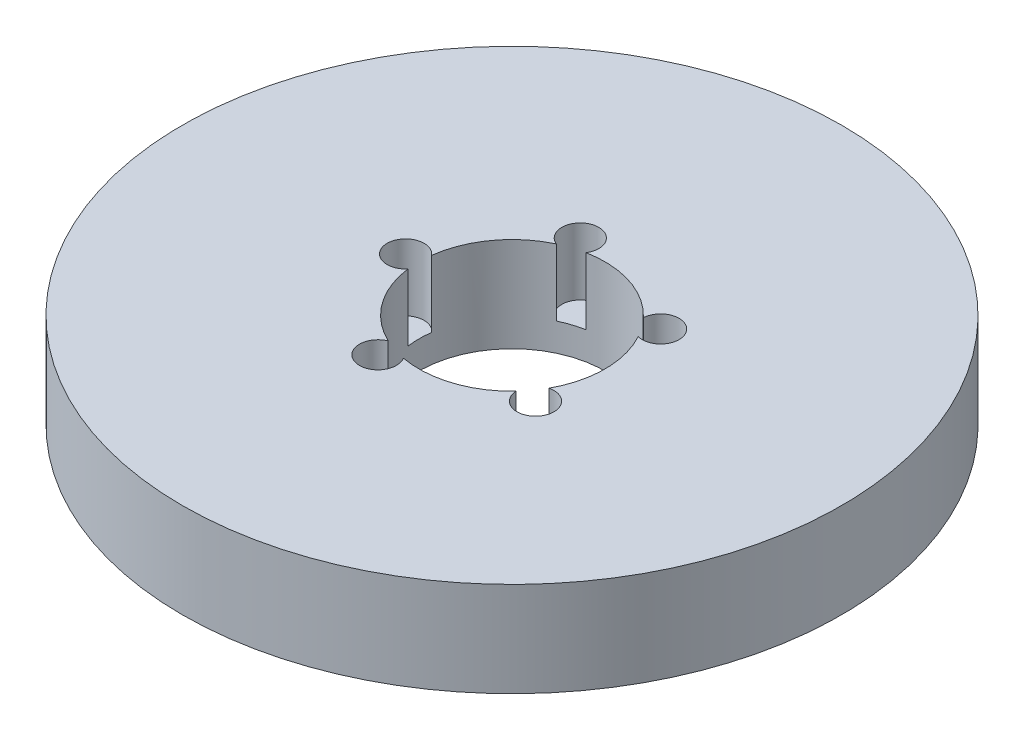
ISO-10303-21;
HEADER;
FILE_DESCRIPTION(('STEP AP214'),'2;1');
FILE_NAME('part.step','',(''),(''),'','','');
FILE_SCHEMA(('AUTOMOTIVE_DESIGN { 1 0 10303 214 1 1 1 1 }'));
ENDSEC;
DATA;
#1=APPLICATION_CONTEXT('core data for automotive mechanical design processes');
#2=APPLICATION_PROTOCOL_DEFINITION('international standard','automotive_design',2000,#1);
#3=PRODUCT_CONTEXT('',#1,'mechanical');
#4=PRODUCT('Part','Part','',(#3));
#5=PRODUCT_RELATED_PRODUCT_CATEGORY('part','',(#4));
#6=PRODUCT_DEFINITION_FORMATION('','',#4);
#7=PRODUCT_DEFINITION_CONTEXT('part definition',#1,'design');
#8=PRODUCT_DEFINITION('design','',#6,#7);
#9=PRODUCT_DEFINITION_SHAPE('','',#8);
#10=(LENGTH_UNIT() NAMED_UNIT(*) SI_UNIT(.MILLI.,.METRE.));
#11=(NAMED_UNIT(*) PLANE_ANGLE_UNIT() SI_UNIT($,.RADIAN.));
#12=(NAMED_UNIT(*) SI_UNIT($,.STERADIAN.) SOLID_ANGLE_UNIT());
#13=UNCERTAINTY_MEASURE_WITH_UNIT(LENGTH_MEASURE(1.E-05),#10,'distance_accuracy_value','');
#14=(GEOMETRIC_REPRESENTATION_CONTEXT(3) GLOBAL_UNCERTAINTY_ASSIGNED_CONTEXT((#13)) GLOBAL_UNIT_ASSIGNED_CONTEXT((#10,
#11,#12)) REPRESENTATION_CONTEXT('',''));
#15=CARTESIAN_POINT('',(0.,0.,0.));
#16=DIRECTION('',(0.,0.,1.));
#17=DIRECTION('',(1.,0.,0.));
#18=AXIS2_PLACEMENT_3D('',#15,#16,#17);
#19=CARTESIAN_POINT('',(0.,28.,0.));
#20=DIRECTION('',(0.,-1.,0.));
#21=DIRECTION('',(0.,0.,-1.));
#22=AXIS2_PLACEMENT_3D('',#19,#20,#21);
#23=CYLINDRICAL_SURFACE('',#22,97.5);
#24=CARTESIAN_POINT('',(0.,28.,0.));
#25=DIRECTION('',(0.,1.,0.));
#26=DIRECTION('',(0.,0.,1.));
#27=AXIS2_PLACEMENT_3D('',#24,#25,#26);
#28=CIRCLE('',#27,97.5);
#29=CARTESIAN_POINT('',(0.,28.,97.5));
#30=VERTEX_POINT('',#29);
#31=EDGE_CURVE('E160',#30,#30,#28,.T.);
#32=ORIENTED_EDGE('',*,*,#31,.F.);
#33=EDGE_LOOP('',(#32));
#34=FACE_BOUND('',#33,.T.);
#35=CARTESIAN_POINT('',(0.,0.,0.));
#36=DIRECTION('',(0.,1.,0.));
#37=DIRECTION('',(0.,0.,1.));
#38=AXIS2_PLACEMENT_3D('',#35,#36,#37);
#39=CIRCLE('',#38,97.5);
#40=CARTESIAN_POINT('',(0.,0.,97.5));
#41=VERTEX_POINT('',#40);
#42=EDGE_CURVE('E153',#41,#41,#39,.T.);
#43=ORIENTED_EDGE('',*,*,#42,.T.);
#44=EDGE_LOOP('',(#43));
#45=FACE_BOUND('',#44,.T.);
#46=ADVANCED_FACE('F39',(#34,#45),#23,.T.);
#47=CARTESIAN_POINT('',(0.,28.,0.));
#48=DIRECTION('',(0.,1.,0.));
#49=DIRECTION('',(0.,0.,1.));
#50=AXIS2_PLACEMENT_3D('',#47,#48,#49);
#51=PLANE('',#50);
#52=CARTESIAN_POINT('',(-9.72634746619186,28.,29.9346194735452));
#53=DIRECTION('',(0.,1.,0.));
#54=DIRECTION('',(0.951056516295155,0.,0.309016994374945));
#55=AXIS2_PLACEMENT_3D('',#52,#53,#54);
#56=CIRCLE('',#55,5.46448151567953);
#57=CARTESIAN_POINT('',(-11.7554117116162,28.,24.8608184798972));
#58=VERTEX_POINT('',#57);
#59=CARTESIAN_POINT('',(-5.10249461183181,28.,27.0224822830218));
#60=VERTEX_POINT('',#59);
#61=EDGE_CURVE('E186',#58,#60,#56,.T.);
#62=ORIENTED_EDGE('',*,*,#61,.F.);
#63=CARTESIAN_POINT('',(0.,28.,0.));
#64=DIRECTION('',(0.,1.,0.));
#65=DIRECTION('',(0.,0.,1.));
#66=AXIS2_PLACEMENT_3D('',#63,#64,#65);
#67=CIRCLE('',#66,27.5);
#68=CARTESIAN_POINT('',(-27.2766654105009,28.,3.49764550570604));
#69=VERTEX_POINT('',#68);
#70=EDGE_CURVE('E148',#69,#58,#67,.T.);
#71=ORIENTED_EDGE('',*,*,#70,.F.);
#72=CARTESIAN_POINT('',(-31.47512157338,28.,0.));
#73=DIRECTION('',(0.,1.,0.));
#74=DIRECTION('',(0.,0.,1.));
#75=AXIS2_PLACEMENT_3D('',#72,#73,#74);
#76=CIRCLE('',#75,5.46448151567953);
#77=CARTESIAN_POINT('',(-27.2766654105009,28.,-3.49764550570604));
#78=VERTEX_POINT('',#77);
#79=EDGE_CURVE('E142',#78,#69,#76,.T.);
#80=ORIENTED_EDGE('',*,*,#79,.F.);
#81=CARTESIAN_POINT('',(-11.7554117116165,28.,-24.860818479897));
#82=VERTEX_POINT('',#81);
#83=EDGE_CURVE('E132',#82,#78,#67,.T.);
#84=ORIENTED_EDGE('',*,*,#83,.F.);
#85=CARTESIAN_POINT('',(-9.72634746619229,28.,-29.9346194735451));
#86=DIRECTION('',(0.,1.,0.));
#87=DIRECTION('',(-0.95105651629515,0.,0.309016994374958));
#88=AXIS2_PLACEMENT_3D('',#85,#86,#87);
#89=CIRCLE('',#88,5.46448151567953);
#90=CARTESIAN_POINT('',(-5.10249461183218,28.,-27.0224822830217));
#91=VERTEX_POINT('',#90);
#92=EDGE_CURVE('E111',#91,#82,#89,.T.);
#93=ORIENTED_EDGE('',*,*,#92,.F.);
#94=CARTESIAN_POINT('',(20.0114214209733,28.,-18.8624763144241));
#95=VERTEX_POINT('',#94);
#96=EDGE_CURVE('E141',#95,#91,#67,.T.);
#97=ORIENTED_EDGE('',*,*,#96,.F.);
#98=CARTESIAN_POINT('',(25.4639082528818,28.,-18.5006122749456));
#99=DIRECTION('',(0.,1.,0.));
#100=DIRECTION('',(-0.58778525229248,0.,-0.809016994374942));
#101=AXIS2_PLACEMENT_3D('',#98,#99,#100);
#102=CIRCLE('',#101,5.46448151567953);
#103=CARTESIAN_POINT('',(24.1231503129754,28.,-13.2031670055935));
#104=VERTEX_POINT('',#103);
#105=EDGE_CURVE('E173',#104,#95,#102,.T.);
#106=ORIENTED_EDGE('',*,*,#105,.F.);
#107=CARTESIAN_POINT('',(24.1231503129756,28.,13.2031670055931));
#108=VERTEX_POINT('',#107);
#109=EDGE_CURVE('E150',#108,#104,#67,.T.);
#110=ORIENTED_EDGE('',*,*,#109,.F.);
#111=CARTESIAN_POINT('',(25.463908252882,28.,18.5006122749453));
#112=DIRECTION('',(0.,1.,0.));
#113=DIRECTION('',(0.587785252292469,0.,-0.809016994374951));
#114=AXIS2_PLACEMENT_3D('',#111,#112,#113);
#115=CIRCLE('',#114,5.46448151567953);
#116=CARTESIAN_POINT('',(20.0114214209735,28.,18.8624763144239));
#117=VERTEX_POINT('',#116);
#118=EDGE_CURVE('E172',#117,#108,#115,.T.);
#119=ORIENTED_EDGE('',*,*,#118,.F.);
#120=EDGE_CURVE('E152',#60,#117,#67,.T.);
#121=ORIENTED_EDGE('',*,*,#120,.F.);
#122=EDGE_LOOP('',(#62,#71,#80,#84,#93,#97,#106,#110,#119,#121));
#123=FACE_BOUND('',#122,.T.);
#124=ORIENTED_EDGE('',*,*,#31,.T.);
#125=EDGE_LOOP('',(#124));
#126=FACE_BOUND('',#125,.T.);
#127=ADVANCED_FACE('F138',(#123,#126),#51,.T.);
#128=CARTESIAN_POINT('',(0.,0.,0.));
#129=DIRECTION('',(0.,1.,0.));
#130=DIRECTION('',(0.,0.,1.));
#131=AXIS2_PLACEMENT_3D('',#128,#129,#130);
#132=PLANE('',#131);
#133=CARTESIAN_POINT('',(0.,0.,0.));
#134=DIRECTION('',(0.,1.,0.));
#135=DIRECTION('',(0.,0.,1.));
#136=AXIS2_PLACEMENT_3D('',#133,#134,#135);
#137=CIRCLE('',#136,27.5);
#138=CARTESIAN_POINT('',(0.,0.,27.5));
#139=VERTEX_POINT('',#138);
#140=EDGE_CURVE('E145',#139,#139,#137,.T.);
#141=ORIENTED_EDGE('',*,*,#140,.T.);
#142=EDGE_LOOP('',(#141));
#143=FACE_BOUND('',#142,.T.);
#144=ORIENTED_EDGE('',*,*,#42,.F.);
#145=EDGE_LOOP('',(#144));
#146=FACE_BOUND('',#145,.T.);
#147=ADVANCED_FACE('F216',(#143,#146),#132,.F.);
#148=CARTESIAN_POINT('',(0.,28.,0.));
#149=DIRECTION('',(0.,-1.,0.));
#150=DIRECTION('',(0.,0.,-1.));
#151=AXIS2_PLACEMENT_3D('',#148,#149,#150);
#152=CYLINDRICAL_SURFACE('',#151,27.5);
#153=DIRECTION('',(0.,1.,0.));
#154=VECTOR('',#153,1.);
#155=CARTESIAN_POINT('',(-11.7554117116162,18.1249343044514,24.8608184798972));
#156=LINE('',#155,#154);
#157=CARTESIAN_POINT('',(-11.7554117116162,8.24986860890274,24.8608184798972));
#158=VERTEX_POINT('',#157);
#159=EDGE_CURVE('E11',#158,#58,#156,.T.);
#160=ORIENTED_EDGE('',*,*,#159,.F.);
#161=CARTESIAN_POINT('',(0.,8.24986860890274,0.));
#162=DIRECTION('',(0.,1.,0.));
#163=DIRECTION('',(0.,0.,1.));
#164=AXIS2_PLACEMENT_3D('',#161,#162,#163);
#165=CIRCLE('',#164,27.5);
#166=CARTESIAN_POINT('',(-5.10249461183181,8.24986860890274,27.0224822830218));
#167=VERTEX_POINT('',#166);
#168=EDGE_CURVE('E192',#158,#167,#165,.T.);
#169=ORIENTED_EDGE('',*,*,#168,.T.);
#170=DIRECTION('',(0.,1.,0.));
#171=VECTOR('',#170,1.);
#172=CARTESIAN_POINT('',(-5.1024946118318,18.1249343044514,27.0224822830218));
#173=LINE('',#172,#171);
#174=EDGE_CURVE('E46',#60,#167,#173,.F.);
#175=ORIENTED_EDGE('',*,*,#174,.F.);
#176=ORIENTED_EDGE('',*,*,#120,.T.);
#177=DIRECTION('',(0.,1.,0.));
#178=VECTOR('',#177,1.);
#179=CARTESIAN_POINT('',(20.0114214209735,18.1249343044514,18.8624763144239));
#180=LINE('',#179,#178);
#181=CARTESIAN_POINT('',(20.0114214209735,8.24986860890274,18.8624763144239));
#182=VERTEX_POINT('',#181);
#183=EDGE_CURVE('E195',#182,#117,#180,.T.);
#184=ORIENTED_EDGE('',*,*,#183,.F.);
#185=CARTESIAN_POINT('',(0.,8.24986860890274,0.));
#186=DIRECTION('',(0.,1.,0.));
#187=DIRECTION('',(0.,0.,1.));
#188=AXIS2_PLACEMENT_3D('',#185,#186,#187);
#189=CIRCLE('',#188,27.5);
#190=CARTESIAN_POINT('',(24.1231503129756,8.24986860890274,13.2031670055931));
#191=VERTEX_POINT('',#190);
#192=EDGE_CURVE('E197',#182,#191,#189,.T.);
#193=ORIENTED_EDGE('',*,*,#192,.T.);
#194=DIRECTION('',(0.,1.,0.));
#195=VECTOR('',#194,1.);
#196=CARTESIAN_POINT('',(24.1231503129756,18.1249343044514,13.2031670055931));
#197=LINE('',#196,#195);
#198=EDGE_CURVE('E168',#108,#191,#197,.F.);
#199=ORIENTED_EDGE('',*,*,#198,.F.);
#200=ORIENTED_EDGE('',*,*,#109,.T.);
#201=DIRECTION('',(0.,1.,0.));
#202=VECTOR('',#201,1.);
#203=CARTESIAN_POINT('',(24.1231503129754,18.1249343044514,-13.2031670055935));
#204=LINE('',#203,#202);
#205=CARTESIAN_POINT('',(24.1231503129754,8.24986860890274,-13.2031670055935));
#206=VERTEX_POINT('',#205);
#207=EDGE_CURVE('E169',#206,#104,#204,.T.);
#208=ORIENTED_EDGE('',*,*,#207,.F.);
#209=CARTESIAN_POINT('',(0.,8.24986860890274,0.));
#210=DIRECTION('',(0.,1.,0.));
#211=DIRECTION('',(0.,0.,1.));
#212=AXIS2_PLACEMENT_3D('',#209,#210,#211);
#213=CIRCLE('',#212,27.5);
#214=CARTESIAN_POINT('',(20.0114214209733,8.24986860890274,-18.8624763144241));
#215=VERTEX_POINT('',#214);
#216=EDGE_CURVE('E332',#206,#215,#213,.T.);
#217=ORIENTED_EDGE('',*,*,#216,.T.);
#218=DIRECTION('',(0.,1.,0.));
#219=VECTOR('',#218,1.);
#220=CARTESIAN_POINT('',(20.0114214209733,18.1249343044514,-18.8624763144242));
#221=LINE('',#220,#219);
#222=EDGE_CURVE('E335',#95,#215,#221,.F.);
#223=ORIENTED_EDGE('',*,*,#222,.F.);
#224=ORIENTED_EDGE('',*,*,#96,.T.);
#225=DIRECTION('',(0.,1.,0.));
#226=VECTOR('',#225,1.);
#227=CARTESIAN_POINT('',(-5.10249461183218,18.1249343044514,-27.0224822830217));
#228=LINE('',#227,#226);
#229=CARTESIAN_POINT('',(-5.10249461183218,8.24986860890274,-27.0224822830217));
#230=VERTEX_POINT('',#229);
#231=EDGE_CURVE('E121',#230,#91,#228,.T.);
#232=ORIENTED_EDGE('',*,*,#231,.F.);
#233=CARTESIAN_POINT('',(0.,8.24986860890274,0.));
#234=DIRECTION('',(0.,1.,0.));
#235=DIRECTION('',(0.,0.,1.));
#236=AXIS2_PLACEMENT_3D('',#233,#234,#235);
#237=CIRCLE('',#236,27.5);
#238=CARTESIAN_POINT('',(-11.7554117116165,8.24986860890274,-24.860818479897));
#239=VERTEX_POINT('',#238);
#240=EDGE_CURVE('E134',#230,#239,#237,.T.);
#241=ORIENTED_EDGE('',*,*,#240,.T.);
#242=DIRECTION('',(0.,1.,0.));
#243=VECTOR('',#242,1.);
#244=CARTESIAN_POINT('',(-11.7554117116165,18.1249343044514,-24.860818479897));
#245=LINE('',#244,#243);
#246=EDGE_CURVE('E117',#82,#239,#245,.F.);
#247=ORIENTED_EDGE('',*,*,#246,.F.);
#248=ORIENTED_EDGE('',*,*,#83,.T.);
#249=DIRECTION('',(0.,1.,0.));
#250=VECTOR('',#249,1.);
#251=CARTESIAN_POINT('',(-27.2766654105009,18.1249343044514,-3.49764550570605));
#252=LINE('',#251,#250);
#253=CARTESIAN_POINT('',(-27.2766654105009,8.24986860890274,-3.49764550570604));
#254=VERTEX_POINT('',#253);
#255=EDGE_CURVE('E338',#254,#78,#252,.T.);
#256=ORIENTED_EDGE('',*,*,#255,.F.);
#257=CARTESIAN_POINT('',(0.,8.24986860890274,0.));
#258=DIRECTION('',(0.,1.,0.));
#259=DIRECTION('',(0.,0.,1.));
#260=AXIS2_PLACEMENT_3D('',#257,#258,#259);
#261=CIRCLE('',#260,27.5);
#262=CARTESIAN_POINT('',(-27.2766654105009,8.24986860890274,3.49764550570604));
#263=VERTEX_POINT('',#262);
#264=EDGE_CURVE('E342',#254,#263,#261,.T.);
#265=ORIENTED_EDGE('',*,*,#264,.T.);
#266=DIRECTION('',(0.,1.,0.));
#267=VECTOR('',#266,1.);
#268=CARTESIAN_POINT('',(-27.2766654105009,18.1249343044514,3.49764550570605));
#269=LINE('',#268,#267);
#270=EDGE_CURVE('E341',#69,#263,#269,.F.);
#271=ORIENTED_EDGE('',*,*,#270,.F.);
#272=ORIENTED_EDGE('',*,*,#70,.T.);
#273=EDGE_LOOP('',(#160,#169,#175,#176,#184,#193,#199,#200,#208,#217,#223,#224,#232,#241,#247,
#248,#256,#265,#271,#272));
#274=FACE_BOUND('',#273,.T.);
#275=ORIENTED_EDGE('',*,*,#140,.F.);
#276=EDGE_LOOP('',(#275));
#277=FACE_BOUND('',#276,.T.);
#278=ADVANCED_FACE('F128',(#274,#277),#152,.F.);
#279=CARTESIAN_POINT('',(-31.47512157338,8.24986860890274,0.));
#280=DIRECTION('',(0.,1.,0.));
#281=DIRECTION('',(0.,0.,1.));
#282=AXIS2_PLACEMENT_3D('',#279,#280,#281);
#283=CYLINDRICAL_SURFACE('',#282,5.46448151567953);
#284=ORIENTED_EDGE('',*,*,#255,.T.);
#285=ORIENTED_EDGE('',*,*,#79,.T.);
#286=ORIENTED_EDGE('',*,*,#270,.T.);
#287=CARTESIAN_POINT('',(-31.47512157338,8.24986860890274,0.));
#288=DIRECTION('',(0.,1.,0.));
#289=DIRECTION('',(0.,0.,1.));
#290=AXIS2_PLACEMENT_3D('',#287,#288,#289);
#291=CIRCLE('',#290,5.46448151567953);
#292=EDGE_CURVE('E149',#254,#263,#291,.T.);
#293=ORIENTED_EDGE('',*,*,#292,.F.);
#294=EDGE_LOOP('',(#284,#285,#286,#293));
#295=FACE_BOUND('',#294,.T.);
#296=ADVANCED_FACE('F227',(#295),#283,.F.);
#297=CARTESIAN_POINT('',(-31.47512157338,8.24986860890274,0.));
#298=DIRECTION('',(0.,1.,0.));
#299=DIRECTION('',(0.,0.,1.));
#300=AXIS2_PLACEMENT_3D('',#297,#298,#299);
#301=PLANE('',#300);
#302=ORIENTED_EDGE('',*,*,#292,.T.);
#303=ORIENTED_EDGE('',*,*,#264,.F.);
#304=EDGE_LOOP('',(#302,#303));
#305=FACE_BOUND('',#304,.T.);
#306=ADVANCED_FACE('F235',(#305),#301,.T.);
#307=CARTESIAN_POINT('',(-9.72634746619229,8.24986860890274,-29.9346194735451));
#308=DIRECTION('',(0.,1.,0.));
#309=DIRECTION('',(0.,0.,1.));
#310=AXIS2_PLACEMENT_3D('',#307,#308,#309);
#311=CYLINDRICAL_SURFACE('',#310,5.46448151567953);
#312=ORIENTED_EDGE('',*,*,#231,.T.);
#313=ORIENTED_EDGE('',*,*,#92,.T.);
#314=ORIENTED_EDGE('',*,*,#246,.T.);
#315=CARTESIAN_POINT('',(-9.72634746619229,8.24986860890274,-29.9346194735451));
#316=DIRECTION('',(0.,1.,0.));
#317=DIRECTION('',(-0.95105651629515,0.,0.309016994374958));
#318=AXIS2_PLACEMENT_3D('',#315,#316,#317);
#319=CIRCLE('',#318,5.46448151567953);
#320=EDGE_CURVE('E127',#230,#239,#319,.T.);
#321=ORIENTED_EDGE('',*,*,#320,.F.);
#322=EDGE_LOOP('',(#312,#313,#314,#321));
#323=FACE_BOUND('',#322,.T.);
#324=ADVANCED_FACE('F116',(#323),#311,.F.);
#325=CARTESIAN_POINT('',(-9.72634746619229,8.24986860890274,-29.9346194735451));
#326=DIRECTION('',(0.,1.,0.));
#327=DIRECTION('',(-0.95105651629515,0.,0.309016994374958));
#328=AXIS2_PLACEMENT_3D('',#325,#326,#327);
#329=PLANE('',#328);
#330=ORIENTED_EDGE('',*,*,#320,.T.);
#331=ORIENTED_EDGE('',*,*,#240,.F.);
#332=EDGE_LOOP('',(#330,#331));
#333=FACE_BOUND('',#332,.T.);
#334=ADVANCED_FACE('F236',(#333),#329,.T.);
#335=CARTESIAN_POINT('',(25.4639082528818,8.24986860890274,-18.5006122749456));
#336=DIRECTION('',(0.,1.,0.));
#337=DIRECTION('',(0.,0.,1.));
#338=AXIS2_PLACEMENT_3D('',#335,#336,#337);
#339=CYLINDRICAL_SURFACE('',#338,5.46448151567953);
#340=ORIENTED_EDGE('',*,*,#207,.T.);
#341=ORIENTED_EDGE('',*,*,#105,.T.);
#342=ORIENTED_EDGE('',*,*,#222,.T.);
#343=CARTESIAN_POINT('',(25.4639082528818,8.24986860890274,-18.5006122749456));
#344=DIRECTION('',(0.,1.,0.));
#345=DIRECTION('',(-0.58778525229248,0.,-0.809016994374942));
#346=AXIS2_PLACEMENT_3D('',#343,#344,#345);
#347=CIRCLE('',#346,5.46448151567953);
#348=EDGE_CURVE('E177',#206,#215,#347,.T.);
#349=ORIENTED_EDGE('',*,*,#348,.F.);
#350=EDGE_LOOP('',(#340,#341,#342,#349));
#351=FACE_BOUND('',#350,.T.);
#352=ADVANCED_FACE('F241',(#351),#339,.F.);
#353=CARTESIAN_POINT('',(25.4639082528818,8.24986860890274,-18.5006122749456));
#354=DIRECTION('',(0.,1.,0.));
#355=DIRECTION('',(-0.58778525229248,0.,-0.809016994374942));
#356=AXIS2_PLACEMENT_3D('',#353,#354,#355);
#357=PLANE('',#356);
#358=ORIENTED_EDGE('',*,*,#348,.T.);
#359=ORIENTED_EDGE('',*,*,#216,.F.);
#360=EDGE_LOOP('',(#358,#359));
#361=FACE_BOUND('',#360,.T.);
#362=ADVANCED_FACE('F244',(#361),#357,.T.);
#363=CARTESIAN_POINT('',(25.463908252882,8.24986860890274,18.5006122749453));
#364=DIRECTION('',(0.,1.,0.));
#365=DIRECTION('',(0.,0.,1.));
#366=AXIS2_PLACEMENT_3D('',#363,#364,#365);
#367=CYLINDRICAL_SURFACE('',#366,5.46448151567953);
#368=ORIENTED_EDGE('',*,*,#183,.T.);
#369=ORIENTED_EDGE('',*,*,#118,.T.);
#370=ORIENTED_EDGE('',*,*,#198,.T.);
#371=CARTESIAN_POINT('',(25.463908252882,8.24986860890274,18.5006122749453));
#372=DIRECTION('',(0.,1.,0.));
#373=DIRECTION('',(0.587785252292469,0.,-0.809016994374951));
#374=AXIS2_PLACEMENT_3D('',#371,#372,#373);
#375=CIRCLE('',#374,5.46448151567953);
#376=EDGE_CURVE('E56',#182,#191,#375,.T.);
#377=ORIENTED_EDGE('',*,*,#376,.F.);
#378=EDGE_LOOP('',(#368,#369,#370,#377));
#379=FACE_BOUND('',#378,.T.);
#380=ADVANCED_FACE('F191',(#379),#367,.F.);
#381=CARTESIAN_POINT('',(25.463908252882,8.24986860890274,18.5006122749453));
#382=DIRECTION('',(0.,1.,0.));
#383=DIRECTION('',(0.587785252292469,0.,-0.809016994374951));
#384=AXIS2_PLACEMENT_3D('',#381,#382,#383);
#385=PLANE('',#384);
#386=ORIENTED_EDGE('',*,*,#376,.T.);
#387=ORIENTED_EDGE('',*,*,#192,.F.);
#388=EDGE_LOOP('',(#386,#387));
#389=FACE_BOUND('',#388,.T.);
#390=ADVANCED_FACE('F208',(#389),#385,.T.);
#391=CARTESIAN_POINT('',(-9.72634746619186,8.24986860890274,29.9346194735452));
#392=DIRECTION('',(0.,1.,0.));
#393=DIRECTION('',(0.,0.,1.));
#394=AXIS2_PLACEMENT_3D('',#391,#392,#393);
#395=CYLINDRICAL_SURFACE('',#394,5.46448151567953);
#396=ORIENTED_EDGE('',*,*,#159,.T.);
#397=ORIENTED_EDGE('',*,*,#61,.T.);
#398=ORIENTED_EDGE('',*,*,#174,.T.);
#399=CARTESIAN_POINT('',(-9.72634746619186,8.24986860890274,29.9346194735452));
#400=DIRECTION('',(0.,1.,0.));
#401=DIRECTION('',(0.951056516295155,0.,0.309016994374945));
#402=AXIS2_PLACEMENT_3D('',#399,#400,#401);
#403=CIRCLE('',#402,5.46448151567953);
#404=EDGE_CURVE('E55',#158,#167,#403,.T.);
#405=ORIENTED_EDGE('',*,*,#404,.F.);
#406=EDGE_LOOP('',(#396,#397,#398,#405));
#407=FACE_BOUND('',#406,.T.);
#408=ADVANCED_FACE('F203',(#407),#395,.F.);
#409=CARTESIAN_POINT('',(-9.72634746619186,8.24986860890274,29.9346194735452));
#410=DIRECTION('',(0.,1.,0.));
#411=DIRECTION('',(0.951056516295155,0.,0.309016994374945));
#412=AXIS2_PLACEMENT_3D('',#409,#410,#411);
#413=PLANE('',#412);
#414=ORIENTED_EDGE('',*,*,#404,.T.);
#415=ORIENTED_EDGE('',*,*,#168,.F.);
#416=EDGE_LOOP('',(#414,#415));
#417=FACE_BOUND('',#416,.T.);
#418=ADVANCED_FACE('F205',(#417),#413,.T.);
#419=CLOSED_SHELL('',(#46,#127,#147,#278,#296,#306,#324,#334,#352,#362,#380,#390,#408,#418));
#420=MANIFOLD_SOLID_BREP('B2',#419);
#421=ADVANCED_BREP_SHAPE_REPRESENTATION('',(#18,#420),#14);
#422=SHAPE_DEFINITION_REPRESENTATION(#9,#421);
ENDSEC;
END-ISO-10303-21;
